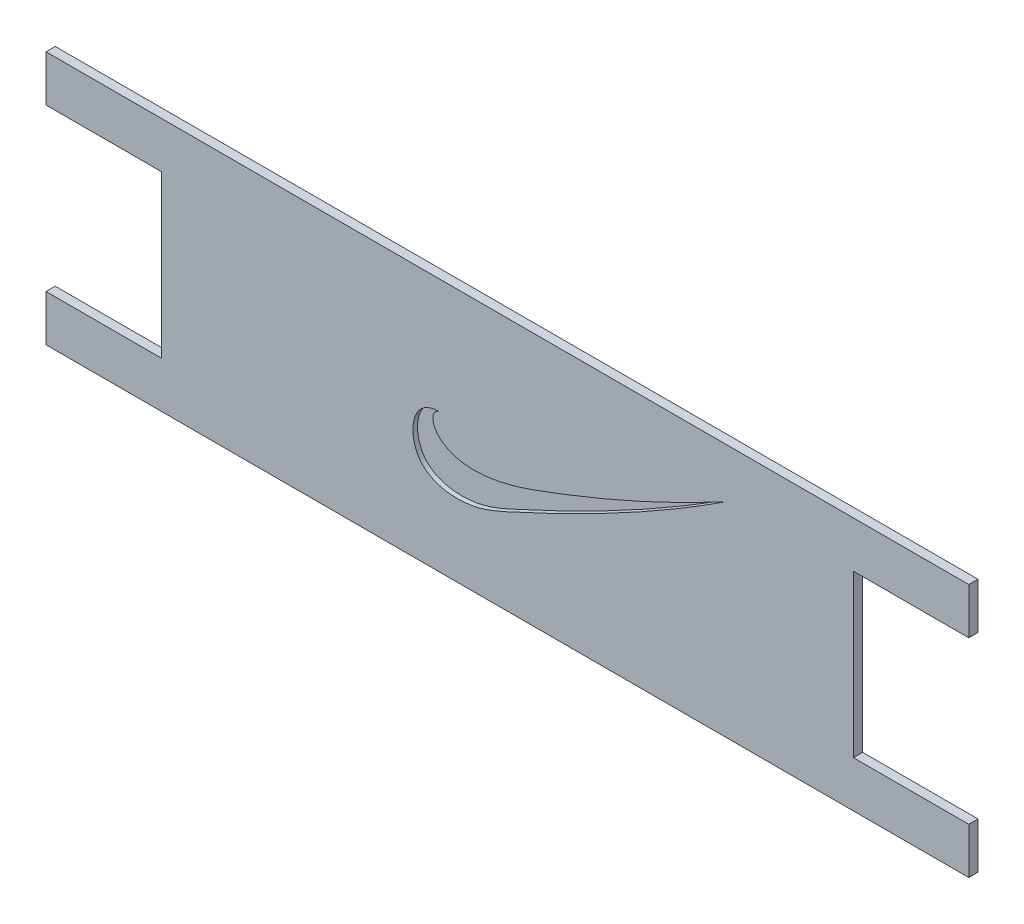
ISO-10303-21;
HEADER;
FILE_DESCRIPTION(('STEP AP214'),'2;1');
FILE_NAME('part.step','',(''),(''),'','','');
FILE_SCHEMA(('AUTOMOTIVE_DESIGN { 1 0 10303 214 1 1 1 1 }'));
ENDSEC;
DATA;
#1=APPLICATION_CONTEXT('core data for automotive mechanical design processes');
#2=APPLICATION_PROTOCOL_DEFINITION('international standard','automotive_design',2000,#1);
#3=PRODUCT_CONTEXT('',#1,'mechanical');
#4=PRODUCT('Part','Part','',(#3));
#5=PRODUCT_RELATED_PRODUCT_CATEGORY('part','',(#4));
#6=PRODUCT_DEFINITION_FORMATION('','',#4);
#7=PRODUCT_DEFINITION_CONTEXT('part definition',#1,'design');
#8=PRODUCT_DEFINITION('design','',#6,#7);
#9=PRODUCT_DEFINITION_SHAPE('','',#8);
#10=(LENGTH_UNIT() NAMED_UNIT(*) SI_UNIT(.MILLI.,.METRE.));
#11=(NAMED_UNIT(*) PLANE_ANGLE_UNIT() SI_UNIT($,.RADIAN.));
#12=(NAMED_UNIT(*) SI_UNIT($,.STERADIAN.) SOLID_ANGLE_UNIT());
#13=UNCERTAINTY_MEASURE_WITH_UNIT(LENGTH_MEASURE(1.E-05),#10,'distance_accuracy_value','');
#14=(GEOMETRIC_REPRESENTATION_CONTEXT(3) GLOBAL_UNCERTAINTY_ASSIGNED_CONTEXT((#13)) GLOBAL_UNIT_ASSIGNED_CONTEXT((#10,
#11,#12)) REPRESENTATION_CONTEXT('',''));
#15=CARTESIAN_POINT('',(0.,0.,0.));
#16=DIRECTION('',(0.,0.,1.));
#17=DIRECTION('',(1.,0.,0.));
#18=AXIS2_PLACEMENT_3D('',#15,#16,#17);
#19=CARTESIAN_POINT('',(1.68703785593946,0.519908743531917,1.49622110929935));
#20=DIRECTION('',(1.,0.,0.));
#21=DIRECTION('',(0.,1.,0.));
#22=AXIS2_PLACEMENT_3D('',#19,#20,#21);
#23=PLANE('',#22);
#24=DIRECTION('',(0.,-1.,0.));
#25=VECTOR('',#24,1.);
#26=CARTESIAN_POINT('',(1.68703785593946,0.519908743531917,0.496221109299349));
#27=LINE('',#26,#25);
#28=CARTESIAN_POINT('',(1.68703785593946,0.519908743531917,0.496221109299349));
#29=VERTEX_POINT('',#28);
#30=CARTESIAN_POINT('',(1.68703785593946,-4.48009125646808,0.496221109299349));
#31=VERTEX_POINT('',#30);
#32=EDGE_CURVE('E181',#29,#31,#27,.T.);
#33=ORIENTED_EDGE('',*,*,#32,.T.);
#34=DIRECTION('',(0.,0.,-1.));
#35=VECTOR('',#34,1.);
#36=CARTESIAN_POINT('',(1.68703785593946,-4.48009125646808,1.49622110929935));
#37=LINE('',#36,#35);
#38=CARTESIAN_POINT('',(1.68703785593946,-4.48009125646808,1.49622110929935));
#39=VERTEX_POINT('',#38);
#40=EDGE_CURVE('E11',#39,#31,#37,.T.);
#41=ORIENTED_EDGE('',*,*,#40,.F.);
#42=DIRECTION('',(0.,-1.,0.));
#43=VECTOR('',#42,1.);
#44=CARTESIAN_POINT('',(1.68703785593946,0.519908743531917,1.49622110929935));
#45=LINE('',#44,#43);
#46=CARTESIAN_POINT('',(1.68703785593946,0.519908743531917,1.49622110929935));
#47=VERTEX_POINT('',#46);
#48=EDGE_CURVE('E216',#47,#39,#45,.T.);
#49=ORIENTED_EDGE('',*,*,#48,.F.);
#50=DIRECTION('',(0.,0.,-1.));
#51=VECTOR('',#50,1.);
#52=CARTESIAN_POINT('',(1.68703785593946,0.519908743531917,1.49622110929935));
#53=LINE('',#52,#51);
#54=EDGE_CURVE('E177',#47,#29,#53,.T.);
#55=ORIENTED_EDGE('',*,*,#54,.T.);
#56=EDGE_LOOP('',(#33,#41,#49,#55));
#57=FACE_BOUND('',#56,.T.);
#58=ADVANCED_FACE('F42',(#57),#23,.F.);
#59=CARTESIAN_POINT('',(14.1870378559395,-4.48009125646808,1.49622110929935));
#60=DIRECTION('',(0.,1.,0.));
#61=DIRECTION('',(-1.,0.,0.));
#62=AXIS2_PLACEMENT_3D('',#59,#60,#61);
#63=PLANE('',#62);
#64=DIRECTION('',(1.,0.,0.));
#65=VECTOR('',#64,1.);
#66=CARTESIAN_POINT('',(14.1870378559395,-4.48009125646808,0.496221109299349));
#67=LINE('',#66,#65);
#68=CARTESIAN_POINT('',(14.1870378559395,-4.48009125646808,0.496221109299349));
#69=VERTEX_POINT('',#68);
#70=EDGE_CURVE('E185',#31,#69,#67,.T.);
#71=ORIENTED_EDGE('',*,*,#70,.T.);
#72=DIRECTION('',(0.,0.,-1.));
#73=VECTOR('',#72,1.);
#74=CARTESIAN_POINT('',(14.1870378559395,-4.48009125646808,1.49622110929935));
#75=LINE('',#74,#73);
#76=CARTESIAN_POINT('',(14.1870378559395,-4.48009125646808,1.49622110929935));
#77=VERTEX_POINT('',#76);
#78=EDGE_CURVE('E50',#77,#69,#75,.T.);
#79=ORIENTED_EDGE('',*,*,#78,.F.);
#80=DIRECTION('',(1.,0.,0.));
#81=VECTOR('',#80,1.);
#82=CARTESIAN_POINT('',(14.1870378559395,-4.48009125646808,1.49622110929935));
#83=LINE('',#82,#81);
#84=EDGE_CURVE('E119',#39,#77,#83,.T.);
#85=ORIENTED_EDGE('',*,*,#84,.F.);
#86=ORIENTED_EDGE('',*,*,#40,.T.);
#87=EDGE_LOOP('',(#71,#79,#85,#86));
#88=FACE_BOUND('',#87,.T.);
#89=ADVANCED_FACE('F373',(#88),#63,.F.);
#90=CARTESIAN_POINT('',(14.1870378559395,-4.48009125646808,1.49622110929935));
#91=DIRECTION('',(1.,0.,0.));
#92=DIRECTION('',(0.,0.,-1.));
#93=AXIS2_PLACEMENT_3D('',#90,#91,#92);
#94=PLANE('',#93);
#95=DIRECTION('',(0.,-1.,0.));
#96=VECTOR('',#95,1.);
#97=CARTESIAN_POINT('',(14.1870378559395,-4.48009125646808,0.496221109299349));
#98=LINE('',#97,#96);
#99=CARTESIAN_POINT('',(14.1870378559395,-21.9800912564681,0.496221109299349));
#100=VERTEX_POINT('',#99);
#101=EDGE_CURVE('E189',#69,#100,#98,.T.);
#102=ORIENTED_EDGE('',*,*,#101,.T.);
#103=DIRECTION('',(0.,0.,-1.));
#104=VECTOR('',#103,1.);
#105=CARTESIAN_POINT('',(14.1870378559395,-21.9800912564681,1.49622110929935));
#106=LINE('',#105,#104);
#107=CARTESIAN_POINT('',(14.1870378559395,-21.9800912564681,1.49622110929935));
#108=VERTEX_POINT('',#107);
#109=EDGE_CURVE('E243',#108,#100,#106,.T.);
#110=ORIENTED_EDGE('',*,*,#109,.F.);
#111=DIRECTION('',(0.,-1.,0.));
#112=VECTOR('',#111,1.);
#113=CARTESIAN_POINT('',(14.1870378559395,-4.48009125646808,1.49622110929935));
#114=LINE('',#113,#112);
#115=EDGE_CURVE('E253',#77,#108,#114,.T.);
#116=ORIENTED_EDGE('',*,*,#115,.F.);
#117=ORIENTED_EDGE('',*,*,#78,.T.);
#118=EDGE_LOOP('',(#102,#110,#116,#117));
#119=FACE_BOUND('',#118,.T.);
#120=ADVANCED_FACE('F251',(#119),#94,.F.);
#121=CARTESIAN_POINT('',(1.68703785593946,-21.9800912564681,1.49622110929935));
#122=DIRECTION('',(0.,-1.,0.));
#123=DIRECTION('',(0.,0.,-1.));
#124=AXIS2_PLACEMENT_3D('',#121,#122,#123);
#125=PLANE('',#124);
#126=DIRECTION('',(-1.,0.,0.));
#127=VECTOR('',#126,1.);
#128=CARTESIAN_POINT('',(1.68703785593946,-21.9800912564681,0.496221109299349));
#129=LINE('',#128,#127);
#130=CARTESIAN_POINT('',(1.68703785593946,-21.9800912564681,0.496221109299349));
#131=VERTEX_POINT('',#130);
#132=EDGE_CURVE('E192',#100,#131,#129,.T.);
#133=ORIENTED_EDGE('',*,*,#132,.T.);
#134=DIRECTION('',(0.,0.,-1.));
#135=VECTOR('',#134,1.);
#136=CARTESIAN_POINT('',(1.68703785593946,-21.9800912564681,1.49622110929935));
#137=LINE('',#136,#135);
#138=CARTESIAN_POINT('',(1.68703785593946,-21.9800912564681,1.49622110929935));
#139=VERTEX_POINT('',#138);
#140=EDGE_CURVE('E239',#139,#131,#137,.T.);
#141=ORIENTED_EDGE('',*,*,#140,.F.);
#142=DIRECTION('',(-1.,0.,0.));
#143=VECTOR('',#142,1.);
#144=CARTESIAN_POINT('',(1.68703785593946,-21.9800912564681,1.49622110929935));
#145=LINE('',#144,#143);
#146=EDGE_CURVE('E271',#108,#139,#145,.T.);
#147=ORIENTED_EDGE('',*,*,#146,.F.);
#148=ORIENTED_EDGE('',*,*,#109,.T.);
#149=EDGE_LOOP('',(#133,#141,#147,#148));
#150=FACE_BOUND('',#149,.T.);
#151=ADVANCED_FACE('F262',(#150),#125,.F.);
#152=CARTESIAN_POINT('',(1.68703785593946,-21.9800912564681,1.49622110929935));
#153=DIRECTION('',(1.,0.,0.));
#154=DIRECTION('',(0.,0.,-1.));
#155=AXIS2_PLACEMENT_3D('',#152,#153,#154);
#156=PLANE('',#155);
#157=DIRECTION('',(0.,-1.,0.));
#158=VECTOR('',#157,1.);
#159=CARTESIAN_POINT('',(1.68703785593946,-21.9800912564681,0.496221109299349));
#160=LINE('',#159,#158);
#161=CARTESIAN_POINT('',(1.68703785593946,-26.9800912564681,0.496221109299349));
#162=VERTEX_POINT('',#161);
#163=EDGE_CURVE('E195',#131,#162,#160,.T.);
#164=ORIENTED_EDGE('',*,*,#163,.T.);
#165=DIRECTION('',(0.,0.,-1.));
#166=VECTOR('',#165,1.);
#167=CARTESIAN_POINT('',(1.68703785593946,-26.9800912564681,1.49622110929935));
#168=LINE('',#167,#166);
#169=CARTESIAN_POINT('',(1.68703785593946,-26.9800912564681,1.49622110929935));
#170=VERTEX_POINT('',#169);
#171=EDGE_CURVE('E235',#170,#162,#168,.T.);
#172=ORIENTED_EDGE('',*,*,#171,.F.);
#173=DIRECTION('',(0.,-1.,0.));
#174=VECTOR('',#173,1.);
#175=CARTESIAN_POINT('',(1.68703785593946,-21.9800912564681,1.49622110929935));
#176=LINE('',#175,#174);
#177=EDGE_CURVE('E268',#139,#170,#176,.T.);
#178=ORIENTED_EDGE('',*,*,#177,.F.);
#179=ORIENTED_EDGE('',*,*,#140,.T.);
#180=EDGE_LOOP('',(#164,#172,#178,#179));
#181=FACE_BOUND('',#180,.T.);
#182=ADVANCED_FACE('F266',(#181),#156,.F.);
#183=CARTESIAN_POINT('',(1.68703785593946,-26.9800912564681,1.49622110929935));
#184=DIRECTION('',(0.,1.,0.));
#185=DIRECTION('',(0.,0.,1.));
#186=AXIS2_PLACEMENT_3D('',#183,#184,#185);
#187=PLANE('',#186);
#188=DIRECTION('',(1.,0.,0.));
#189=VECTOR('',#188,1.);
#190=CARTESIAN_POINT('',(1.68703785593946,-26.9800912564681,0.496221109299349));
#191=LINE('',#190,#189);
#192=CARTESIAN_POINT('',(101.687037855939,-26.9800912564681,0.496221109299349));
#193=VERTEX_POINT('',#192);
#194=EDGE_CURVE('E197',#162,#193,#191,.T.);
#195=ORIENTED_EDGE('',*,*,#194,.T.);
#196=DIRECTION('',(0.,0.,-1.));
#197=VECTOR('',#196,1.);
#198=CARTESIAN_POINT('',(101.687037855939,-26.9800912564681,1.49622110929935));
#199=LINE('',#198,#197);
#200=CARTESIAN_POINT('',(101.687037855939,-26.9800912564681,1.49622110929935));
#201=VERTEX_POINT('',#200);
#202=EDGE_CURVE('E231',#201,#193,#199,.T.);
#203=ORIENTED_EDGE('',*,*,#202,.F.);
#204=DIRECTION('',(1.,0.,0.));
#205=VECTOR('',#204,1.);
#206=CARTESIAN_POINT('',(1.68703785593946,-26.9800912564681,1.49622110929935));
#207=LINE('',#206,#205);
#208=EDGE_CURVE('E270',#170,#201,#207,.T.);
#209=ORIENTED_EDGE('',*,*,#208,.F.);
#210=ORIENTED_EDGE('',*,*,#171,.T.);
#211=EDGE_LOOP('',(#195,#203,#209,#210));
#212=FACE_BOUND('',#211,.T.);
#213=ADVANCED_FACE('F363',(#212),#187,.F.);
#214=CARTESIAN_POINT('',(101.687037855939,-21.9800912564681,1.49622110929935));
#215=DIRECTION('',(-1.,0.,0.));
#216=DIRECTION('',(0.,0.,1.));
#217=AXIS2_PLACEMENT_3D('',#214,#215,#216);
#218=PLANE('',#217);
#219=DIRECTION('',(0.,1.,0.));
#220=VECTOR('',#219,1.);
#221=CARTESIAN_POINT('',(101.687037855939,-21.9800912564681,0.496221109299349));
#222=LINE('',#221,#220);
#223=CARTESIAN_POINT('',(101.687037855939,-21.9800912564681,0.496221109299349));
#224=VERTEX_POINT('',#223);
#225=EDGE_CURVE('E200',#193,#224,#222,.T.);
#226=ORIENTED_EDGE('',*,*,#225,.T.);
#227=DIRECTION('',(0.,0.,-1.));
#228=VECTOR('',#227,1.);
#229=CARTESIAN_POINT('',(101.687037855939,-21.9800912564681,1.49622110929935));
#230=LINE('',#229,#228);
#231=CARTESIAN_POINT('',(101.687037855939,-21.9800912564681,1.49622110929935));
#232=VERTEX_POINT('',#231);
#233=EDGE_CURVE('E227',#232,#224,#230,.T.);
#234=ORIENTED_EDGE('',*,*,#233,.F.);
#235=DIRECTION('',(0.,1.,0.));
#236=VECTOR('',#235,1.);
#237=CARTESIAN_POINT('',(101.687037855939,-21.9800912564681,1.49622110929935));
#238=LINE('',#237,#236);
#239=EDGE_CURVE('E274',#201,#232,#238,.T.);
#240=ORIENTED_EDGE('',*,*,#239,.F.);
#241=ORIENTED_EDGE('',*,*,#202,.T.);
#242=EDGE_LOOP('',(#226,#234,#240,#241));
#243=FACE_BOUND('',#242,.T.);
#244=ADVANCED_FACE('F359',(#243),#218,.F.);
#245=CARTESIAN_POINT('',(89.1870378559395,-21.9800912564681,1.49622110929935));
#246=DIRECTION('',(0.,-1.,0.));
#247=DIRECTION('',(0.,0.,-1.));
#248=AXIS2_PLACEMENT_3D('',#245,#246,#247);
#249=PLANE('',#248);
#250=DIRECTION('',(-1.,0.,0.));
#251=VECTOR('',#250,1.);
#252=CARTESIAN_POINT('',(89.1870378559395,-21.9800912564681,0.496221109299349));
#253=LINE('',#252,#251);
#254=CARTESIAN_POINT('',(89.1870378559395,-21.9800912564681,0.496221109299349));
#255=VERTEX_POINT('',#254);
#256=EDGE_CURVE('E203',#224,#255,#253,.T.);
#257=ORIENTED_EDGE('',*,*,#256,.T.);
#258=DIRECTION('',(0.,0.,-1.));
#259=VECTOR('',#258,1.);
#260=CARTESIAN_POINT('',(89.1870378559395,-21.9800912564681,1.49622110929935));
#261=LINE('',#260,#259);
#262=CARTESIAN_POINT('',(89.1870378559395,-21.9800912564681,1.49622110929935));
#263=VERTEX_POINT('',#262);
#264=EDGE_CURVE('E223',#263,#255,#261,.T.);
#265=ORIENTED_EDGE('',*,*,#264,.F.);
#266=DIRECTION('',(-1.,0.,0.));
#267=VECTOR('',#266,1.);
#268=CARTESIAN_POINT('',(89.1870378559395,-21.9800912564681,1.49622110929935));
#269=LINE('',#268,#267);
#270=EDGE_CURVE('E282',#232,#263,#269,.T.);
#271=ORIENTED_EDGE('',*,*,#270,.F.);
#272=ORIENTED_EDGE('',*,*,#233,.T.);
#273=EDGE_LOOP('',(#257,#265,#271,#272));
#274=FACE_BOUND('',#273,.T.);
#275=ADVANCED_FACE('F355',(#274),#249,.F.);
#276=CARTESIAN_POINT('',(89.1870378559395,-4.48009125646808,1.49622110929935));
#277=DIRECTION('',(-1.,0.,0.));
#278=DIRECTION('',(0.,0.,1.));
#279=AXIS2_PLACEMENT_3D('',#276,#277,#278);
#280=PLANE('',#279);
#281=DIRECTION('',(0.,1.,0.));
#282=VECTOR('',#281,1.);
#283=CARTESIAN_POINT('',(89.1870378559395,-4.48009125646808,0.496221109299349));
#284=LINE('',#283,#282);
#285=CARTESIAN_POINT('',(89.1870378559395,-4.48009125646808,0.496221109299349));
#286=VERTEX_POINT('',#285);
#287=EDGE_CURVE('E206',#255,#286,#284,.T.);
#288=ORIENTED_EDGE('',*,*,#287,.T.);
#289=DIRECTION('',(0.,0.,-1.));
#290=VECTOR('',#289,1.);
#291=CARTESIAN_POINT('',(89.1870378559395,-4.48009125646808,1.49622110929935));
#292=LINE('',#291,#290);
#293=CARTESIAN_POINT('',(89.1870378559395,-4.48009125646808,1.49622110929935));
#294=VERTEX_POINT('',#293);
#295=EDGE_CURVE('E168',#294,#286,#292,.T.);
#296=ORIENTED_EDGE('',*,*,#295,.F.);
#297=DIRECTION('',(0.,1.,0.));
#298=VECTOR('',#297,1.);
#299=CARTESIAN_POINT('',(89.1870378559395,-4.48009125646808,1.49622110929935));
#300=LINE('',#299,#298);
#301=EDGE_CURVE('E154',#263,#294,#300,.T.);
#302=ORIENTED_EDGE('',*,*,#301,.F.);
#303=ORIENTED_EDGE('',*,*,#264,.T.);
#304=EDGE_LOOP('',(#288,#296,#302,#303));
#305=FACE_BOUND('',#304,.T.);
#306=ADVANCED_FACE('F352',(#305),#280,.F.);
#307=CARTESIAN_POINT('',(89.1870378559395,-4.48009125646808,1.49622110929935));
#308=DIRECTION('',(0.,1.,0.));
#309=DIRECTION('',(0.,0.,1.));
#310=AXIS2_PLACEMENT_3D('',#307,#308,#309);
#311=PLANE('',#310);
#312=DIRECTION('',(1.,0.,0.));
#313=VECTOR('',#312,1.);
#314=CARTESIAN_POINT('',(89.1870378559395,-4.48009125646808,0.496221109299349));
#315=LINE('',#314,#313);
#316=CARTESIAN_POINT('',(101.687037855939,-4.48009125646808,0.496221109299349));
#317=VERTEX_POINT('',#316);
#318=EDGE_CURVE('E164',#286,#317,#315,.T.);
#319=ORIENTED_EDGE('',*,*,#318,.T.);
#320=DIRECTION('',(0.,0.,-1.));
#321=VECTOR('',#320,1.);
#322=CARTESIAN_POINT('',(101.687037855939,-4.48009125646808,1.49622110929935));
#323=LINE('',#322,#321);
#324=CARTESIAN_POINT('',(101.687037855939,-4.48009125646808,1.49622110929935));
#325=VERTEX_POINT('',#324);
#326=EDGE_CURVE('E161',#325,#317,#323,.T.);
#327=ORIENTED_EDGE('',*,*,#326,.F.);
#328=DIRECTION('',(1.,0.,0.));
#329=VECTOR('',#328,1.);
#330=CARTESIAN_POINT('',(89.1870378559395,-4.48009125646808,1.49622110929935));
#331=LINE('',#330,#329);
#332=EDGE_CURVE('E147',#294,#325,#331,.T.);
#333=ORIENTED_EDGE('',*,*,#332,.F.);
#334=ORIENTED_EDGE('',*,*,#295,.T.);
#335=EDGE_LOOP('',(#319,#327,#333,#334));
#336=FACE_BOUND('',#335,.T.);
#337=ADVANCED_FACE('F162',(#336),#311,.F.);
#338=CARTESIAN_POINT('',(101.687037855939,0.519908743531917,1.49622110929935));
#339=DIRECTION('',(-1.,0.,0.));
#340=DIRECTION('',(0.,0.,1.));
#341=AXIS2_PLACEMENT_3D('',#338,#339,#340);
#342=PLANE('',#341);
#343=DIRECTION('',(0.,1.,0.));
#344=VECTOR('',#343,1.);
#345=CARTESIAN_POINT('',(101.687037855939,0.519908743531917,0.496221109299349));
#346=LINE('',#345,#344);
#347=CARTESIAN_POINT('',(101.687037855939,0.519908743531917,0.496221109299349));
#348=VERTEX_POINT('',#347);
#349=EDGE_CURVE('E211',#317,#348,#346,.T.);
#350=ORIENTED_EDGE('',*,*,#349,.T.);
#351=DIRECTION('',(0.,0.,-1.));
#352=VECTOR('',#351,1.);
#353=CARTESIAN_POINT('',(101.687037855939,0.519908743531917,1.49622110929935));
#354=LINE('',#353,#352);
#355=CARTESIAN_POINT('',(101.687037855939,0.519908743531917,1.49622110929935));
#356=VERTEX_POINT('',#355);
#357=EDGE_CURVE('E169',#356,#348,#354,.T.);
#358=ORIENTED_EDGE('',*,*,#357,.F.);
#359=DIRECTION('',(0.,1.,0.));
#360=VECTOR('',#359,1.);
#361=CARTESIAN_POINT('',(101.687037855939,0.519908743531917,1.49622110929935));
#362=LINE('',#361,#360);
#363=EDGE_CURVE('E151',#325,#356,#362,.T.);
#364=ORIENTED_EDGE('',*,*,#363,.F.);
#365=ORIENTED_EDGE('',*,*,#326,.T.);
#366=EDGE_LOOP('',(#350,#358,#364,#365));
#367=FACE_BOUND('',#366,.T.);
#368=ADVANCED_FACE('F171',(#367),#342,.F.);
#369=CARTESIAN_POINT('',(1.68703785593946,0.519908743531917,1.49622110929935));
#370=DIRECTION('',(0.,-1.,0.));
#371=DIRECTION('',(0.,0.,-1.));
#372=AXIS2_PLACEMENT_3D('',#369,#370,#371);
#373=PLANE('',#372);
#374=DIRECTION('',(-1.,0.,0.));
#375=VECTOR('',#374,1.);
#376=CARTESIAN_POINT('',(1.68703785593946,0.519908743531917,0.496221109299349));
#377=LINE('',#376,#375);
#378=EDGE_CURVE('E111',#348,#29,#377,.T.);
#379=ORIENTED_EDGE('',*,*,#378,.T.);
#380=ORIENTED_EDGE('',*,*,#54,.F.);
#381=DIRECTION('',(-1.,0.,0.));
#382=VECTOR('',#381,1.);
#383=CARTESIAN_POINT('',(1.68703785593946,0.519908743531917,1.49622110929935));
#384=LINE('',#383,#382);
#385=EDGE_CURVE('E66',#356,#47,#384,.T.);
#386=ORIENTED_EDGE('',*,*,#385,.F.);
#387=ORIENTED_EDGE('',*,*,#357,.T.);
#388=EDGE_LOOP('',(#379,#380,#386,#387));
#389=FACE_BOUND('',#388,.T.);
#390=ADVANCED_FACE('F342',(#389),#373,.F.);
#391=CARTESIAN_POINT('',(25.8424432613448,-6.60207835717579,1.49622110929935));
#392=DIRECTION('',(0.,0.,-1.));
#393=DIRECTION('',(-1.,0.,0.));
#394=AXIS2_PLACEMENT_3D('',#391,#392,#393);
#395=PLANE('',#394);
#396=CARTESIAN_POINT('',(75.2691262584783,-4.9333568905543,1.49622110929935));
#397=CARTESIAN_POINT('',(69.6748920548865,-7.89957137834894,1.49622110929935));
#398=CARTESIAN_POINT('',(62.9524672773362,-11.1252073032552,1.49622110929935));
#399=CARTESIAN_POINT('',(43.4927571471915,-18.2103123106615,1.49622110929935));
#400=CARTESIAN_POINT('',(42.5795267376545,-11.914178068081,1.49622110929935));
#401=CARTESIAN_POINT('',(44.4371856733208,-11.9612257004064,1.49622110929935));
#402=B_SPLINE_CURVE_WITH_KNOTS('',3,(#396,#397,#398,#399,#400,#401),.UNSPECIFIED.,.F.,.F.,(4,1,
1,4),(0.,0.40738033918613,0.482234890207092,1.),.UNSPECIFIED.);
#403=CARTESIAN_POINT('',(75.2691262584783,-4.9333568905543,1.49622110929935));
#404=VERTEX_POINT('',#403);
#405=CARTESIAN_POINT('',(44.4371856733208,-11.9612257004064,1.49622110929935));
#406=VERTEX_POINT('',#405);
#407=EDGE_CURVE('E299',#404,#406,#402,.T.);
#408=ORIENTED_EDGE('',*,*,#407,.F.);
#409=CARTESIAN_POINT('',(44.4371856733208,-11.9612257004064,1.49622110929935));
#410=CARTESIAN_POINT('',(41.2504154927812,-11.7684509099057,1.49622110929935));
#411=CARTESIAN_POINT('',(40.4208807672569,-18.6870048510555,1.49622110929935));
#412=CARTESIAN_POINT('',(47.4675364785836,-19.5287156020687,1.49622110929935));
#413=CARTESIAN_POINT('',(58.4375242043421,-14.6915373787783,1.49622110929935));
#414=CARTESIAN_POINT('',(67.8406955708347,-9.79446268544349,1.49622110929935));
#415=CARTESIAN_POINT('',(75.2691262584783,-4.9333568905543,1.49622110929935));
#416=B_SPLINE_CURVE_WITH_KNOTS('',3,(#409,#410,#411,#412,#413,#414,#415),.UNSPECIFIED.,.F.,.F.,
(4,1,1,1,4),(0.,0.163170519365482,0.2917639299808,0.388322167502561,1.),.UNSPECIFIED.);
#417=EDGE_CURVE('E57',#406,#404,#416,.T.);
#418=ORIENTED_EDGE('',*,*,#417,.F.);
#419=EDGE_LOOP('',(#408,#418));
#420=FACE_BOUND('',#419,.T.);
#421=ORIENTED_EDGE('',*,*,#48,.T.);
#422=ORIENTED_EDGE('',*,*,#84,.T.);
#423=ORIENTED_EDGE('',*,*,#115,.T.);
#424=ORIENTED_EDGE('',*,*,#146,.T.);
#425=ORIENTED_EDGE('',*,*,#177,.T.);
#426=ORIENTED_EDGE('',*,*,#208,.T.);
#427=ORIENTED_EDGE('',*,*,#239,.T.);
#428=ORIENTED_EDGE('',*,*,#270,.T.);
#429=ORIENTED_EDGE('',*,*,#301,.T.);
#430=ORIENTED_EDGE('',*,*,#332,.T.);
#431=ORIENTED_EDGE('',*,*,#363,.T.);
#432=ORIENTED_EDGE('',*,*,#385,.T.);
#433=EDGE_LOOP('',(#421,#422,#423,#424,#425,#426,#427,#428,#429,#430,#431,#432));
#434=FACE_BOUND('',#433,.T.);
#435=ADVANCED_FACE('F149',(#420,#434),#395,.F.);
#436=CARTESIAN_POINT('',(25.8424432613448,-6.60207835717579,0.496221109299349));
#437=DIRECTION('',(0.,0.,-1.));
#438=DIRECTION('',(-1.,0.,0.));
#439=AXIS2_PLACEMENT_3D('',#436,#437,#438);
#440=PLANE('',#439);
#441=ORIENTED_EDGE('',*,*,#32,.F.);
#442=ORIENTED_EDGE('',*,*,#378,.F.);
#443=ORIENTED_EDGE('',*,*,#349,.F.);
#444=ORIENTED_EDGE('',*,*,#318,.F.);
#445=ORIENTED_EDGE('',*,*,#287,.F.);
#446=ORIENTED_EDGE('',*,*,#256,.F.);
#447=ORIENTED_EDGE('',*,*,#225,.F.);
#448=ORIENTED_EDGE('',*,*,#194,.F.);
#449=ORIENTED_EDGE('',*,*,#163,.F.);
#450=ORIENTED_EDGE('',*,*,#132,.F.);
#451=ORIENTED_EDGE('',*,*,#101,.F.);
#452=ORIENTED_EDGE('',*,*,#70,.F.);
#453=EDGE_LOOP('',(#441,#442,#443,#444,#445,#446,#447,#448,#449,#450,#451,#452));
#454=FACE_BOUND('',#453,.T.);
#455=ADVANCED_FACE('F257',(#454),#440,.T.);
#456=CARTESIAN_POINT('',(44.4371856733208,-11.9612257004064,0.996221109299349));
#457=CARTESIAN_POINT('',(41.2504154927812,-11.7684509099057,0.996221109299349));
#458=CARTESIAN_POINT('',(40.4208807672569,-18.6870048510555,0.996221109299349));
#459=CARTESIAN_POINT('',(47.4675364785836,-19.5287156020687,0.996221109299349));
#460=CARTESIAN_POINT('',(58.4375242043421,-14.6915373787783,0.996221109299349));
#461=CARTESIAN_POINT('',(67.8406955708347,-9.79446268544349,0.996221109299349));
#462=CARTESIAN_POINT('',(75.2691262584783,-4.9333568905543,0.996221109299349));
#463=B_SPLINE_CURVE_WITH_KNOTS('',3,(#456,#457,#458,#459,#460,#461,#462),.UNSPECIFIED.,.F.,.F.,
(4,1,1,1,4),(0.,0.163170519365482,0.2917639299808,0.388322167502561,1.),.UNSPECIFIED.);
#464=DIRECTION('',(0.,0.,1.));
#465=VECTOR('',#464,1.);
#466=SURFACE_OF_LINEAR_EXTRUSION('',#463,#465);
#467=ORIENTED_EDGE('',*,*,#417,.T.);
#468=DIRECTION('',(0.,0.,1.));
#469=VECTOR('',#468,1.);
#470=CARTESIAN_POINT('',(75.2691262584783,-4.9333568905543,0.996221109299349));
#471=LINE('',#470,#469);
#472=CARTESIAN_POINT('',(75.2691262584783,-4.9333568905543,0.996221109299349));
#473=VERTEX_POINT('',#472);
#474=EDGE_CURVE('E290',#473,#404,#471,.T.);
#475=ORIENTED_EDGE('',*,*,#474,.F.);
#476=CARTESIAN_POINT('',(44.4371856733208,-11.9612257004064,0.996221109299349));
#477=VERTEX_POINT('',#476);
#478=EDGE_CURVE('E297',#477,#473,#463,.T.);
#479=ORIENTED_EDGE('',*,*,#478,.F.);
#480=DIRECTION('',(0.,0.,1.));
#481=VECTOR('',#480,1.);
#482=CARTESIAN_POINT('',(44.4371856733208,-11.9612257004064,0.996221109299349));
#483=LINE('',#482,#481);
#484=EDGE_CURVE('E186',#477,#406,#483,.T.);
#485=ORIENTED_EDGE('',*,*,#484,.T.);
#486=EDGE_LOOP('',(#467,#475,#479,#485));
#487=FACE_BOUND('',#486,.T.);
#488=ADVANCED_FACE('F337',(#487),#466,.F.);
#489=CARTESIAN_POINT('',(75.2691262584783,-4.9333568905543,0.996221109299349));
#490=CARTESIAN_POINT('',(69.6748920548865,-7.89957137834894,0.996221109299349));
#491=CARTESIAN_POINT('',(62.9524672773362,-11.1252073032552,0.996221109299349));
#492=CARTESIAN_POINT('',(43.4927571471915,-18.2103123106615,0.996221109299349));
#493=CARTESIAN_POINT('',(42.5795267376545,-11.914178068081,0.996221109299349));
#494=CARTESIAN_POINT('',(44.4371856733208,-11.9612257004064,0.996221109299349));
#495=B_SPLINE_CURVE_WITH_KNOTS('',3,(#489,#490,#491,#492,#493,#494),.UNSPECIFIED.,.F.,.F.,(4,1,
1,4),(0.,0.40738033918613,0.482234890207092,1.),.UNSPECIFIED.);
#496=DIRECTION('',(0.,0.,1.));
#497=VECTOR('',#496,1.);
#498=SURFACE_OF_LINEAR_EXTRUSION('',#495,#497);
#499=ORIENTED_EDGE('',*,*,#407,.T.);
#500=ORIENTED_EDGE('',*,*,#484,.F.);
#501=EDGE_CURVE('E291',#473,#477,#495,.T.);
#502=ORIENTED_EDGE('',*,*,#501,.F.);
#503=ORIENTED_EDGE('',*,*,#474,.T.);
#504=EDGE_LOOP('',(#499,#500,#502,#503));
#505=FACE_BOUND('',#504,.T.);
#506=ADVANCED_FACE('F332',(#505),#498,.F.);
#507=CARTESIAN_POINT('',(56.0907714337042,-15.6056556220081,0.996221109299349));
#508=DIRECTION('',(0.,0.,-1.));
#509=DIRECTION('',(-1.,0.,0.));
#510=AXIS2_PLACEMENT_3D('',#507,#508,#509);
#511=PLANE('',#510);
#512=ORIENTED_EDGE('',*,*,#478,.T.);
#513=ORIENTED_EDGE('',*,*,#501,.T.);
#514=EDGE_LOOP('',(#512,#513));
#515=FACE_BOUND('',#514,.T.);
#516=ADVANCED_FACE('F336',(#515),#511,.F.);
#517=CLOSED_SHELL('',(#58,#89,#120,#151,#182,#213,#244,#275,#306,#337,#368,#390,#435,#455,#488,
#506,#516));
#518=MANIFOLD_SOLID_BREP('B2',#517);
#519=ADVANCED_BREP_SHAPE_REPRESENTATION('',(#18,#518),#14);
#520=SHAPE_DEFINITION_REPRESENTATION(#9,#519);
ENDSEC;
END-ISO-10303-21;
